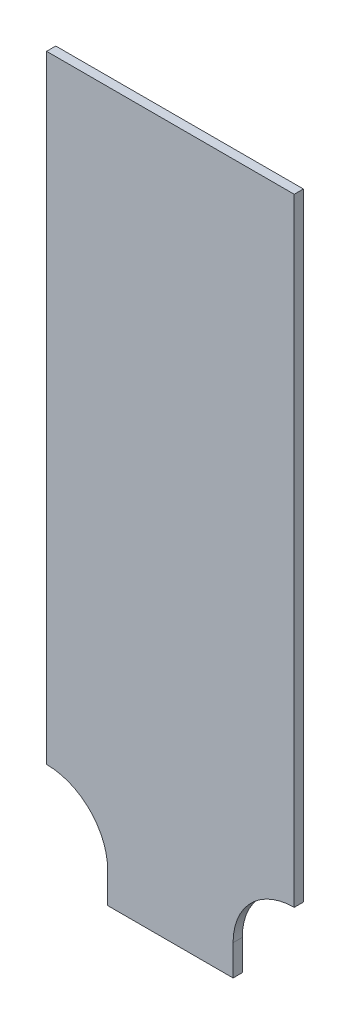
ISO-10303-21;
HEADER;
FILE_DESCRIPTION(('STEP AP214'),'2;1');
FILE_NAME('part.step','',(''),(''),'','','');
FILE_SCHEMA(('AUTOMOTIVE_DESIGN { 1 0 10303 214 1 1 1 1 }'));
ENDSEC;
DATA;
#1=APPLICATION_CONTEXT('core data for automotive mechanical design processes');
#2=APPLICATION_PROTOCOL_DEFINITION('international standard','automotive_design',2000,#1);
#3=PRODUCT_CONTEXT('',#1,'mechanical');
#4=PRODUCT('Part','Part','',(#3));
#5=PRODUCT_RELATED_PRODUCT_CATEGORY('part','',(#4));
#6=PRODUCT_DEFINITION_FORMATION('','',#4);
#7=PRODUCT_DEFINITION_CONTEXT('part definition',#1,'design');
#8=PRODUCT_DEFINITION('design','',#6,#7);
#9=PRODUCT_DEFINITION_SHAPE('','',#8);
#10=(LENGTH_UNIT() NAMED_UNIT(*) SI_UNIT(.MILLI.,.METRE.));
#11=(NAMED_UNIT(*) PLANE_ANGLE_UNIT() SI_UNIT($,.RADIAN.));
#12=(NAMED_UNIT(*) SI_UNIT($,.STERADIAN.) SOLID_ANGLE_UNIT());
#13=UNCERTAINTY_MEASURE_WITH_UNIT(LENGTH_MEASURE(1.E-05),#10,'distance_accuracy_value','');
#14=(GEOMETRIC_REPRESENTATION_CONTEXT(3) GLOBAL_UNCERTAINTY_ASSIGNED_CONTEXT((#13)) GLOBAL_UNIT_ASSIGNED_CONTEXT((#10,
#11,#12)) REPRESENTATION_CONTEXT('',''));
#15=CARTESIAN_POINT('',(0.,0.,0.));
#16=DIRECTION('',(0.,0.,1.));
#17=DIRECTION('',(1.,0.,0.));
#18=AXIS2_PLACEMENT_3D('',#15,#16,#17);
#19=CARTESIAN_POINT('',(-40.5,232.,3.));
#20=DIRECTION('',(1.,0.,0.));
#21=DIRECTION('',(0.,1.,0.));
#22=AXIS2_PLACEMENT_3D('',#19,#20,#21);
#23=PLANE('',#22);
#24=DIRECTION('',(0.,-1.,0.));
#25=VECTOR('',#24,1.);
#26=CARTESIAN_POINT('',(-40.5,232.,0.));
#27=LINE('',#26,#25);
#28=CARTESIAN_POINT('',(-40.5,232.,0.));
#29=VERTEX_POINT('',#28);
#30=CARTESIAN_POINT('',(-40.5,30.,0.));
#31=VERTEX_POINT('',#30);
#32=EDGE_CURVE('E127',#29,#31,#27,.T.);
#33=ORIENTED_EDGE('',*,*,#32,.T.);
#34=DIRECTION('',(0.,0.,-1.));
#35=VECTOR('',#34,1.);
#36=CARTESIAN_POINT('',(-40.5,30.,3.));
#37=LINE('',#36,#35);
#38=CARTESIAN_POINT('',(-40.5,30.,3.));
#39=VERTEX_POINT('',#38);
#40=EDGE_CURVE('E11',#39,#31,#37,.T.);
#41=ORIENTED_EDGE('',*,*,#40,.F.);
#42=DIRECTION('',(0.,-1.,0.));
#43=VECTOR('',#42,1.);
#44=CARTESIAN_POINT('',(-40.5,232.,3.));
#45=LINE('',#44,#43);
#46=CARTESIAN_POINT('',(-40.5,232.,3.));
#47=VERTEX_POINT('',#46);
#48=EDGE_CURVE('E141',#47,#39,#45,.T.);
#49=ORIENTED_EDGE('',*,*,#48,.F.);
#50=DIRECTION('',(0.,0.,-1.));
#51=VECTOR('',#50,1.);
#52=CARTESIAN_POINT('',(-40.5,232.,3.));
#53=LINE('',#52,#51);
#54=EDGE_CURVE('E123',#47,#29,#53,.T.);
#55=ORIENTED_EDGE('',*,*,#54,.T.);
#56=EDGE_LOOP('',(#33,#41,#49,#55));
#57=FACE_BOUND('',#56,.T.);
#58=ADVANCED_FACE('F31',(#57),#23,.F.);
#59=CARTESIAN_POINT('',(-40.5,9.99999999999997,3.));
#60=DIRECTION('',(0.,0.,-1.));
#61=DIRECTION('',(-1.,0.,0.));
#62=AXIS2_PLACEMENT_3D('',#59,#60,#61);
#63=CYLINDRICAL_SURFACE('',#62,20.);
#64=CARTESIAN_POINT('',(-40.5,9.99999999999997,0.));
#65=DIRECTION('',(0.,0.,-1.));
#66=DIRECTION('',(-1.,0.,0.));
#67=AXIS2_PLACEMENT_3D('',#64,#65,#66);
#68=CIRCLE('',#67,20.);
#69=CARTESIAN_POINT('',(-20.5,9.99999999999997,0.));
#70=VERTEX_POINT('',#69);
#71=EDGE_CURVE('E130',#31,#70,#68,.T.);
#72=ORIENTED_EDGE('',*,*,#71,.T.);
#73=DIRECTION('',(0.,0.,-1.));
#74=VECTOR('',#73,1.);
#75=CARTESIAN_POINT('',(-20.5,9.99999999999997,3.));
#76=LINE('',#75,#74);
#77=CARTESIAN_POINT('',(-20.5,9.99999999999997,3.));
#78=VERTEX_POINT('',#77);
#79=EDGE_CURVE('E39',#78,#70,#76,.T.);
#80=ORIENTED_EDGE('',*,*,#79,.F.);
#81=CARTESIAN_POINT('',(-40.5,9.99999999999997,3.));
#82=DIRECTION('',(0.,0.,-1.));
#83=DIRECTION('',(-1.,0.,0.));
#84=AXIS2_PLACEMENT_3D('',#81,#82,#83);
#85=CIRCLE('',#84,20.);
#86=EDGE_CURVE('E90',#39,#78,#85,.T.);
#87=ORIENTED_EDGE('',*,*,#86,.F.);
#88=ORIENTED_EDGE('',*,*,#40,.T.);
#89=EDGE_LOOP('',(#72,#80,#87,#88));
#90=FACE_BOUND('',#89,.T.);
#91=ADVANCED_FACE('F176',(#90),#63,.F.);
#92=CARTESIAN_POINT('',(-20.5,0.,3.));
#93=DIRECTION('',(1.,0.,0.));
#94=DIRECTION('',(0.,1.,0.));
#95=AXIS2_PLACEMENT_3D('',#92,#93,#94);
#96=PLANE('',#95);
#97=DIRECTION('',(0.,-1.,0.));
#98=VECTOR('',#97,1.);
#99=CARTESIAN_POINT('',(-20.5,0.,0.));
#100=LINE('',#99,#98);
#101=CARTESIAN_POINT('',(-20.5,0.,0.));
#102=VERTEX_POINT('',#101);
#103=EDGE_CURVE('E132',#70,#102,#100,.T.);
#104=ORIENTED_EDGE('',*,*,#103,.T.);
#105=DIRECTION('',(0.,0.,-1.));
#106=VECTOR('',#105,1.);
#107=CARTESIAN_POINT('',(-20.5,0.,3.));
#108=LINE('',#107,#106);
#109=CARTESIAN_POINT('',(-20.5,0.,3.));
#110=VERTEX_POINT('',#109);
#111=EDGE_CURVE('E148',#110,#102,#108,.T.);
#112=ORIENTED_EDGE('',*,*,#111,.F.);
#113=DIRECTION('',(0.,-1.,0.));
#114=VECTOR('',#113,1.);
#115=CARTESIAN_POINT('',(-20.5,0.,3.));
#116=LINE('',#115,#114);
#117=EDGE_CURVE('E156',#78,#110,#116,.T.);
#118=ORIENTED_EDGE('',*,*,#117,.F.);
#119=ORIENTED_EDGE('',*,*,#79,.T.);
#120=EDGE_LOOP('',(#104,#112,#118,#119));
#121=FACE_BOUND('',#120,.T.);
#122=ADVANCED_FACE('F154',(#121),#96,.F.);
#123=CARTESIAN_POINT('',(20.5,0.,3.));
#124=DIRECTION('',(0.,1.,0.));
#125=DIRECTION('',(0.,0.,1.));
#126=AXIS2_PLACEMENT_3D('',#123,#124,#125);
#127=PLANE('',#126);
#128=DIRECTION('',(1.,0.,0.));
#129=VECTOR('',#128,1.);
#130=CARTESIAN_POINT('',(20.5,0.,0.));
#131=LINE('',#130,#129);
#132=CARTESIAN_POINT('',(20.5,0.,0.));
#133=VERTEX_POINT('',#132);
#134=EDGE_CURVE('E134',#102,#133,#131,.T.);
#135=ORIENTED_EDGE('',*,*,#134,.T.);
#136=DIRECTION('',(0.,0.,-1.));
#137=VECTOR('',#136,1.);
#138=CARTESIAN_POINT('',(20.5,0.,3.));
#139=LINE('',#138,#137);
#140=CARTESIAN_POINT('',(20.5,0.,3.));
#141=VERTEX_POINT('',#140);
#142=EDGE_CURVE('E145',#141,#133,#139,.T.);
#143=ORIENTED_EDGE('',*,*,#142,.F.);
#144=DIRECTION('',(1.,0.,0.));
#145=VECTOR('',#144,1.);
#146=CARTESIAN_POINT('',(20.5,0.,3.));
#147=LINE('',#146,#145);
#148=EDGE_CURVE('E168',#110,#141,#147,.T.);
#149=ORIENTED_EDGE('',*,*,#148,.F.);
#150=ORIENTED_EDGE('',*,*,#111,.T.);
#151=EDGE_LOOP('',(#135,#143,#149,#150));
#152=FACE_BOUND('',#151,.T.);
#153=ADVANCED_FACE('F164',(#152),#127,.F.);
#154=CARTESIAN_POINT('',(20.5,0.,3.));
#155=DIRECTION('',(-1.,0.,0.));
#156=DIRECTION('',(0.,-1.,0.));
#157=AXIS2_PLACEMENT_3D('',#154,#155,#156);
#158=PLANE('',#157);
#159=DIRECTION('',(0.,1.,0.));
#160=VECTOR('',#159,1.);
#161=CARTESIAN_POINT('',(20.5,0.,0.));
#162=LINE('',#161,#160);
#163=CARTESIAN_POINT('',(20.5,9.99999999999998,0.));
#164=VERTEX_POINT('',#163);
#165=EDGE_CURVE('E136',#133,#164,#162,.T.);
#166=ORIENTED_EDGE('',*,*,#165,.T.);
#167=DIRECTION('',(0.,0.,-1.));
#168=VECTOR('',#167,1.);
#169=CARTESIAN_POINT('',(20.5,9.99999999999998,3.));
#170=LINE('',#169,#168);
#171=CARTESIAN_POINT('',(20.5,9.99999999999998,3.));
#172=VERTEX_POINT('',#171);
#173=EDGE_CURVE('E118',#172,#164,#170,.T.);
#174=ORIENTED_EDGE('',*,*,#173,.F.);
#175=DIRECTION('',(0.,1.,0.));
#176=VECTOR('',#175,1.);
#177=CARTESIAN_POINT('',(20.5,0.,3.));
#178=LINE('',#177,#176);
#179=EDGE_CURVE('E109',#141,#172,#178,.T.);
#180=ORIENTED_EDGE('',*,*,#179,.F.);
#181=ORIENTED_EDGE('',*,*,#142,.T.);
#182=EDGE_LOOP('',(#166,#174,#180,#181));
#183=FACE_BOUND('',#182,.T.);
#184=ADVANCED_FACE('F167',(#183),#158,.F.);
#185=CARTESIAN_POINT('',(40.5,9.99999999999997,3.));
#186=DIRECTION('',(0.,0.,-1.));
#187=DIRECTION('',(-1.,0.,0.));
#188=AXIS2_PLACEMENT_3D('',#185,#186,#187);
#189=CYLINDRICAL_SURFACE('',#188,20.);
#190=CARTESIAN_POINT('',(40.5,9.99999999999997,0.));
#191=DIRECTION('',(0.,0.,-1.));
#192=DIRECTION('',(1.,0.,0.));
#193=AXIS2_PLACEMENT_3D('',#190,#191,#192);
#194=CIRCLE('',#193,20.);
#195=CARTESIAN_POINT('',(40.5,30.,0.));
#196=VERTEX_POINT('',#195);
#197=EDGE_CURVE('E117',#164,#196,#194,.T.);
#198=ORIENTED_EDGE('',*,*,#197,.T.);
#199=DIRECTION('',(0.,0.,-1.));
#200=VECTOR('',#199,1.);
#201=CARTESIAN_POINT('',(40.5,30.,3.));
#202=LINE('',#201,#200);
#203=CARTESIAN_POINT('',(40.5,30.,3.));
#204=VERTEX_POINT('',#203);
#205=EDGE_CURVE('E114',#204,#196,#202,.T.);
#206=ORIENTED_EDGE('',*,*,#205,.F.);
#207=CARTESIAN_POINT('',(40.5,9.99999999999997,3.));
#208=DIRECTION('',(0.,0.,-1.));
#209=DIRECTION('',(1.,0.,0.));
#210=AXIS2_PLACEMENT_3D('',#207,#208,#209);
#211=CIRCLE('',#210,20.);
#212=EDGE_CURVE('E103',#172,#204,#211,.T.);
#213=ORIENTED_EDGE('',*,*,#212,.F.);
#214=ORIENTED_EDGE('',*,*,#173,.T.);
#215=EDGE_LOOP('',(#198,#206,#213,#214));
#216=FACE_BOUND('',#215,.T.);
#217=ADVANCED_FACE('F115',(#216),#189,.F.);
#218=CARTESIAN_POINT('',(40.5,232.,3.));
#219=DIRECTION('',(-1.,0.,0.));
#220=DIRECTION('',(0.,-1.,0.));
#221=AXIS2_PLACEMENT_3D('',#218,#219,#220);
#222=PLANE('',#221);
#223=DIRECTION('',(0.,1.,0.));
#224=VECTOR('',#223,1.);
#225=CARTESIAN_POINT('',(40.5,232.,0.));
#226=LINE('',#225,#224);
#227=CARTESIAN_POINT('',(40.5,232.,0.));
#228=VERTEX_POINT('',#227);
#229=EDGE_CURVE('E76',#196,#228,#226,.T.);
#230=ORIENTED_EDGE('',*,*,#229,.T.);
#231=DIRECTION('',(0.,0.,-1.));
#232=VECTOR('',#231,1.);
#233=CARTESIAN_POINT('',(40.5,232.,3.));
#234=LINE('',#233,#232);
#235=CARTESIAN_POINT('',(40.5,232.,3.));
#236=VERTEX_POINT('',#235);
#237=EDGE_CURVE('E119',#236,#228,#234,.T.);
#238=ORIENTED_EDGE('',*,*,#237,.F.);
#239=DIRECTION('',(0.,1.,0.));
#240=VECTOR('',#239,1.);
#241=CARTESIAN_POINT('',(40.5,232.,3.));
#242=LINE('',#241,#240);
#243=EDGE_CURVE('E107',#204,#236,#242,.T.);
#244=ORIENTED_EDGE('',*,*,#243,.F.);
#245=ORIENTED_EDGE('',*,*,#205,.T.);
#246=EDGE_LOOP('',(#230,#238,#244,#245));
#247=FACE_BOUND('',#246,.T.);
#248=ADVANCED_FACE('F121',(#247),#222,.F.);
#249=CARTESIAN_POINT('',(40.5,232.,3.));
#250=DIRECTION('',(0.,-1.,0.));
#251=DIRECTION('',(0.,0.,-1.));
#252=AXIS2_PLACEMENT_3D('',#249,#250,#251);
#253=PLANE('',#252);
#254=DIRECTION('',(-1.,0.,0.));
#255=VECTOR('',#254,1.);
#256=CARTESIAN_POINT('',(40.5,232.,0.));
#257=LINE('',#256,#255);
#258=EDGE_CURVE('E82',#228,#29,#257,.T.);
#259=ORIENTED_EDGE('',*,*,#258,.T.);
#260=ORIENTED_EDGE('',*,*,#54,.F.);
#261=DIRECTION('',(-1.,0.,0.));
#262=VECTOR('',#261,1.);
#263=CARTESIAN_POINT('',(40.5,232.,3.));
#264=LINE('',#263,#262);
#265=EDGE_CURVE('E47',#236,#47,#264,.T.);
#266=ORIENTED_EDGE('',*,*,#265,.F.);
#267=ORIENTED_EDGE('',*,*,#237,.T.);
#268=EDGE_LOOP('',(#259,#260,#266,#267));
#269=FACE_BOUND('',#268,.T.);
#270=ADVANCED_FACE('F192',(#269),#253,.F.);
#271=CARTESIAN_POINT('',(-40.5,9.99999999999997,3.));
#272=DIRECTION('',(0.,0.,-1.));
#273=DIRECTION('',(-1.,0.,0.));
#274=AXIS2_PLACEMENT_3D('',#271,#272,#273);
#275=PLANE('',#274);
#276=ORIENTED_EDGE('',*,*,#48,.T.);
#277=ORIENTED_EDGE('',*,*,#86,.T.);
#278=ORIENTED_EDGE('',*,*,#117,.T.);
#279=ORIENTED_EDGE('',*,*,#148,.T.);
#280=ORIENTED_EDGE('',*,*,#179,.T.);
#281=ORIENTED_EDGE('',*,*,#212,.T.);
#282=ORIENTED_EDGE('',*,*,#243,.T.);
#283=ORIENTED_EDGE('',*,*,#265,.T.);
#284=EDGE_LOOP('',(#276,#277,#278,#279,#280,#281,#282,#283));
#285=FACE_BOUND('',#284,.T.);
#286=ADVANCED_FACE('F105',(#285),#275,.F.);
#287=CARTESIAN_POINT('',(-40.5,9.99999999999997,0.));
#288=DIRECTION('',(0.,0.,-1.));
#289=DIRECTION('',(-1.,0.,0.));
#290=AXIS2_PLACEMENT_3D('',#287,#288,#289);
#291=PLANE('',#290);
#292=ORIENTED_EDGE('',*,*,#32,.F.);
#293=ORIENTED_EDGE('',*,*,#258,.F.);
#294=ORIENTED_EDGE('',*,*,#229,.F.);
#295=ORIENTED_EDGE('',*,*,#197,.F.);
#296=ORIENTED_EDGE('',*,*,#165,.F.);
#297=ORIENTED_EDGE('',*,*,#134,.F.);
#298=ORIENTED_EDGE('',*,*,#103,.F.);
#299=ORIENTED_EDGE('',*,*,#71,.F.);
#300=EDGE_LOOP('',(#292,#293,#294,#295,#296,#297,#298,#299));
#301=FACE_BOUND('',#300,.T.);
#302=ADVANCED_FACE('F160',(#301),#291,.T.);
#303=CLOSED_SHELL('',(#58,#91,#122,#153,#184,#217,#248,#270,#286,#302));
#304=MANIFOLD_SOLID_BREP('B2',#303);
#305=ADVANCED_BREP_SHAPE_REPRESENTATION('',(#18,#304),#14);
#306=SHAPE_DEFINITION_REPRESENTATION(#9,#305);
ENDSEC;
END-ISO-10303-21;
